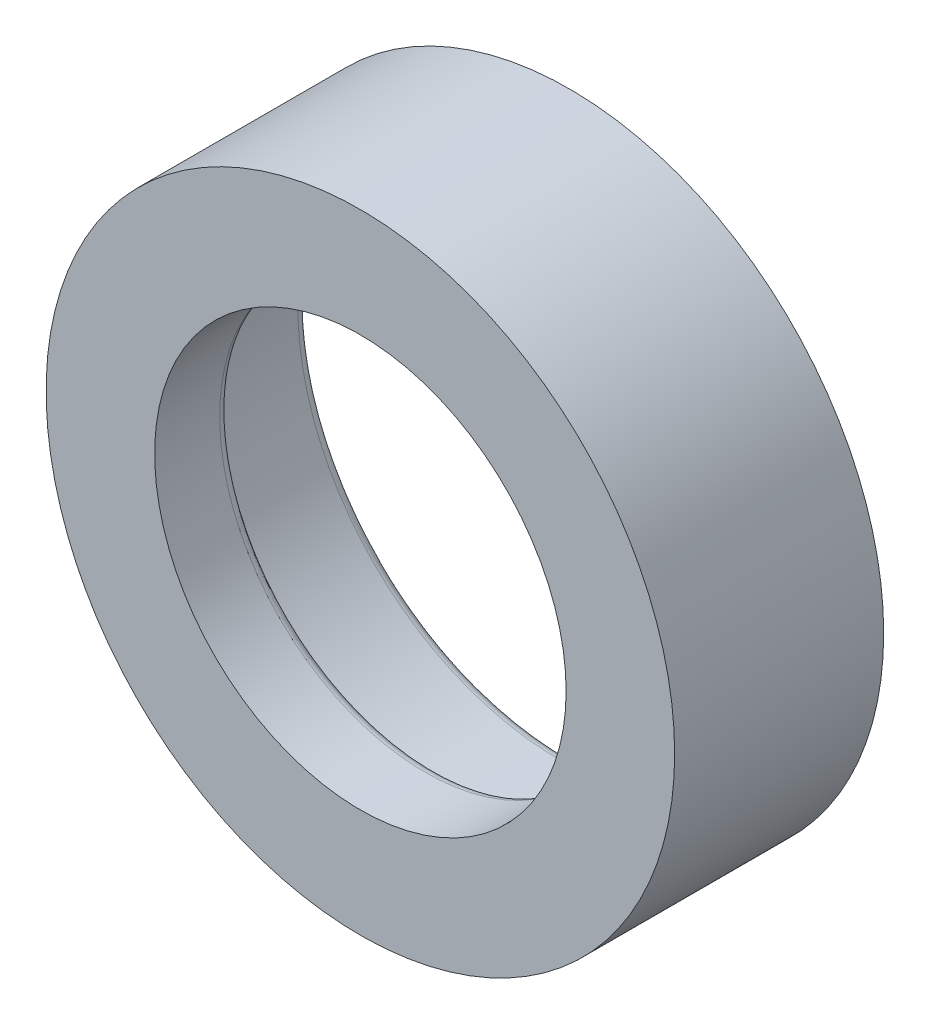
ISO-10303-21;
HEADER;
FILE_DESCRIPTION(('STEP AP214'),'2;1');
FILE_NAME('part.step','',(''),(''),'','','');
FILE_SCHEMA(('AUTOMOTIVE_DESIGN { 1 0 10303 214 1 1 1 1 }'));
ENDSEC;
DATA;
#1=APPLICATION_CONTEXT('core data for automotive mechanical design processes');
#2=APPLICATION_PROTOCOL_DEFINITION('international standard','automotive_design',2000,#1);
#3=PRODUCT_CONTEXT('',#1,'mechanical');
#4=PRODUCT('Part','Part','',(#3));
#5=PRODUCT_RELATED_PRODUCT_CATEGORY('part','',(#4));
#6=PRODUCT_DEFINITION_FORMATION('','',#4);
#7=PRODUCT_DEFINITION_CONTEXT('part definition',#1,'design');
#8=PRODUCT_DEFINITION('design','',#6,#7);
#9=PRODUCT_DEFINITION_SHAPE('','',#8);
#10=(LENGTH_UNIT() NAMED_UNIT(*) SI_UNIT(.MILLI.,.METRE.));
#11=(NAMED_UNIT(*) PLANE_ANGLE_UNIT() SI_UNIT($,.RADIAN.));
#12=(NAMED_UNIT(*) SI_UNIT($,.STERADIAN.) SOLID_ANGLE_UNIT());
#13=UNCERTAINTY_MEASURE_WITH_UNIT(LENGTH_MEASURE(1.E-05),#10,'distance_accuracy_value','');
#14=(GEOMETRIC_REPRESENTATION_CONTEXT(3) GLOBAL_UNCERTAINTY_ASSIGNED_CONTEXT((#13)) GLOBAL_UNIT_ASSIGNED_CONTEXT((#10,
#11,#12)) REPRESENTATION_CONTEXT('',''));
#15=CARTESIAN_POINT('',(0.,0.,0.));
#16=DIRECTION('',(0.,0.,1.));
#17=DIRECTION('',(1.,0.,0.));
#18=AXIS2_PLACEMENT_3D('',#15,#16,#17);
#19=CARTESIAN_POINT('',(0.,0.,20.32));
#20=DIRECTION('',(0.,0.,-1.));
#21=DIRECTION('',(-1.,0.,0.));
#22=AXIS2_PLACEMENT_3D('',#19,#20,#21);
#23=CYLINDRICAL_SURFACE('',#22,30.55);
#24=CARTESIAN_POINT('',(0.,0.,20.32));
#25=DIRECTION('',(0.,0.,1.));
#26=DIRECTION('',(1.,0.,0.));
#27=AXIS2_PLACEMENT_3D('',#24,#25,#26);
#28=CIRCLE('',#27,30.55);
#29=CARTESIAN_POINT('',(30.55,0.,20.32));
#30=VERTEX_POINT('',#29);
#31=EDGE_CURVE('E84',#30,#30,#28,.T.);
#32=ORIENTED_EDGE('',*,*,#31,.F.);
#33=EDGE_LOOP('',(#32));
#34=FACE_BOUND('',#33,.T.);
#35=CARTESIAN_POINT('',(0.,0.,0.));
#36=DIRECTION('',(0.,0.,1.));
#37=DIRECTION('',(1.,0.,0.));
#38=AXIS2_PLACEMENT_3D('',#35,#36,#37);
#39=CIRCLE('',#38,30.55);
#40=CARTESIAN_POINT('',(30.55,0.,0.));
#41=VERTEX_POINT('',#40);
#42=EDGE_CURVE('E80',#41,#41,#39,.T.);
#43=ORIENTED_EDGE('',*,*,#42,.T.);
#44=EDGE_LOOP('',(#43));
#45=FACE_BOUND('',#44,.T.);
#46=ADVANCED_FACE('F42',(#34,#45),#23,.T.);
#47=CARTESIAN_POINT('',(0.,0.,20.32));
#48=DIRECTION('',(0.,0.,1.));
#49=DIRECTION('',(1.,0.,0.));
#50=AXIS2_PLACEMENT_3D('',#47,#48,#49);
#51=PLANE('',#50);
#52=CARTESIAN_POINT('',(0.,0.,20.32));
#53=DIRECTION('',(0.,0.,1.));
#54=DIRECTION('',(1.,0.,0.));
#55=AXIS2_PLACEMENT_3D('',#52,#53,#54);
#56=CIRCLE('',#55,20.);
#57=CARTESIAN_POINT('',(20.,0.,20.32));
#58=VERTEX_POINT('',#57);
#59=EDGE_CURVE('E131',#58,#58,#56,.T.);
#60=ORIENTED_EDGE('',*,*,#59,.F.);
#61=EDGE_LOOP('',(#60));
#62=FACE_BOUND('',#61,.T.);
#63=ORIENTED_EDGE('',*,*,#31,.T.);
#64=EDGE_LOOP('',(#63));
#65=FACE_BOUND('',#64,.T.);
#66=ADVANCED_FACE('F93',(#62,#65),#51,.T.);
#67=CARTESIAN_POINT('',(0.,0.,0.));
#68=DIRECTION('',(0.,0.,1.));
#69=DIRECTION('',(1.,0.,0.));
#70=AXIS2_PLACEMENT_3D('',#67,#68,#69);
#71=PLANE('',#70);
#72=CARTESIAN_POINT('',(0.,0.,0.));
#73=DIRECTION('',(0.,0.,1.));
#74=DIRECTION('',(1.,0.,0.));
#75=AXIS2_PLACEMENT_3D('',#72,#73,#74);
#76=CIRCLE('',#75,26.404);
#77=CARTESIAN_POINT('',(26.404,0.,0.));
#78=VERTEX_POINT('',#77);
#79=EDGE_CURVE('E54',#78,#78,#76,.T.);
#80=ORIENTED_EDGE('',*,*,#79,.T.);
#81=EDGE_LOOP('',(#80));
#82=FACE_BOUND('',#81,.T.);
#83=ORIENTED_EDGE('',*,*,#42,.F.);
#84=EDGE_LOOP('',(#83));
#85=FACE_BOUND('',#84,.T.);
#86=ADVANCED_FACE('F100',(#82,#85),#71,.F.);
#87=CARTESIAN_POINT('',(0.,0.,13.));
#88=DIRECTION('',(0.,0.,-1.));
#89=DIRECTION('',(0.,1.,0.));
#90=AXIS2_PLACEMENT_3D('',#87,#88,#89);
#91=CYLINDRICAL_SURFACE('',#90,25.404);
#92=CARTESIAN_POINT('',(0.,0.,0.999999999999999));
#93=DIRECTION('',(0.,0.,1.));
#94=DIRECTION('',(1.,0.,0.));
#95=AXIS2_PLACEMENT_3D('',#92,#93,#94);
#96=CIRCLE('',#95,25.404);
#97=CARTESIAN_POINT('',(25.404,0.,0.999999999999999));
#98=VERTEX_POINT('',#97);
#99=EDGE_CURVE('E60',#98,#98,#96,.F.);
#100=ORIENTED_EDGE('',*,*,#99,.T.);
#101=EDGE_LOOP('',(#100));
#102=FACE_BOUND('',#101,.T.);
#103=CARTESIAN_POINT('',(0.,0.,13.));
#104=DIRECTION('',(0.,0.,-1.));
#105=DIRECTION('',(0.,1.,0.));
#106=AXIS2_PLACEMENT_3D('',#103,#104,#105);
#107=CIRCLE('',#106,25.404);
#108=CARTESIAN_POINT('',(0.,25.404,13.));
#109=VERTEX_POINT('',#108);
#110=EDGE_CURVE('E85',#109,#109,#107,.T.);
#111=ORIENTED_EDGE('',*,*,#110,.F.);
#112=EDGE_LOOP('',(#111));
#113=FACE_BOUND('',#112,.T.);
#114=ADVANCED_FACE('F102',(#102,#113),#91,.F.);
#115=CARTESIAN_POINT('',(0.,0.,13.));
#116=DIRECTION('',(0.,0.,-1.));
#117=DIRECTION('',(0.,1.,0.));
#118=AXIS2_PLACEMENT_3D('',#115,#116,#117);
#119=PLANE('',#118);
#120=CARTESIAN_POINT('',(0.,0.,13.));
#121=DIRECTION('',(0.,0.,-1.));
#122=DIRECTION('',(0.,1.,0.));
#123=AXIS2_PLACEMENT_3D('',#120,#121,#122);
#124=CIRCLE('',#123,21.);
#125=CARTESIAN_POINT('',(0.,21.,13.));
#126=VERTEX_POINT('',#125);
#127=EDGE_CURVE('E11',#126,#126,#124,.F.);
#128=ORIENTED_EDGE('',*,*,#127,.T.);
#129=EDGE_LOOP('',(#128));
#130=FACE_BOUND('',#129,.T.);
#131=ORIENTED_EDGE('',*,*,#110,.T.);
#132=EDGE_LOOP('',(#131));
#133=FACE_BOUND('',#132,.T.);
#134=ADVANCED_FACE('F107',(#130,#133),#119,.T.);
#135=CARTESIAN_POINT('',(0.,0.,0.));
#136=DIRECTION('',(0.,0.,1.));
#137=DIRECTION('',(1.,0.,0.));
#138=AXIS2_PLACEMENT_3D('',#135,#136,#137);
#139=CYLINDRICAL_SURFACE('',#138,20.);
#140=CARTESIAN_POINT('',(0.,0.,14.));
#141=DIRECTION('',(0.,0.,-1.));
#142=DIRECTION('',(0.,1.,0.));
#143=AXIS2_PLACEMENT_3D('',#140,#141,#142);
#144=CIRCLE('',#143,20.);
#145=CARTESIAN_POINT('',(0.,20.,14.));
#146=VERTEX_POINT('',#145);
#147=EDGE_CURVE('E49',#146,#146,#144,.T.);
#148=ORIENTED_EDGE('',*,*,#147,.T.);
#149=EDGE_LOOP('',(#148));
#150=FACE_BOUND('',#149,.T.);
#151=ORIENTED_EDGE('',*,*,#59,.T.);
#152=EDGE_LOOP('',(#151));
#153=FACE_BOUND('',#152,.T.);
#154=ADVANCED_FACE('F114',(#150,#153),#139,.F.);
#155=CARTESIAN_POINT('',(0.,0.,0.999999999999999));
#156=DIRECTION('',(0.,0.,1.));
#157=DIRECTION('',(1.,0.,0.));
#158=AXIS2_PLACEMENT_3D('',#155,#156,#157);
#159=TOROIDAL_SURFACE('',#158,26.404,1.);
#160=ORIENTED_EDGE('',*,*,#79,.F.);
#161=EDGE_LOOP('',(#160));
#162=FACE_BOUND('',#161,.T.);
#163=ORIENTED_EDGE('',*,*,#99,.F.);
#164=EDGE_LOOP('',(#163));
#165=FACE_BOUND('',#164,.T.);
#166=ADVANCED_FACE('F112',(#162,#165),#159,.T.);
#167=CARTESIAN_POINT('',(0.,0.,14.));
#168=DIRECTION('',(0.,0.,-1.));
#169=DIRECTION('',(0.,1.,0.));
#170=AXIS2_PLACEMENT_3D('',#167,#168,#169);
#171=TOROIDAL_SURFACE('',#170,21.,1.);
#172=ORIENTED_EDGE('',*,*,#127,.F.);
#173=EDGE_LOOP('',(#172));
#174=FACE_BOUND('',#173,.T.);
#175=ORIENTED_EDGE('',*,*,#147,.F.);
#176=EDGE_LOOP('',(#175));
#177=FACE_BOUND('',#176,.T.);
#178=ADVANCED_FACE('F44',(#174,#177),#171,.T.);
#179=CLOSED_SHELL('',(#46,#66,#86,#114,#134,#154,#166,#178));
#180=MANIFOLD_SOLID_BREP('B2',#179);
#181=ADVANCED_BREP_SHAPE_REPRESENTATION('',(#18,#180),#14);
#182=SHAPE_DEFINITION_REPRESENTATION(#9,#181);
ENDSEC;
END-ISO-10303-21;
